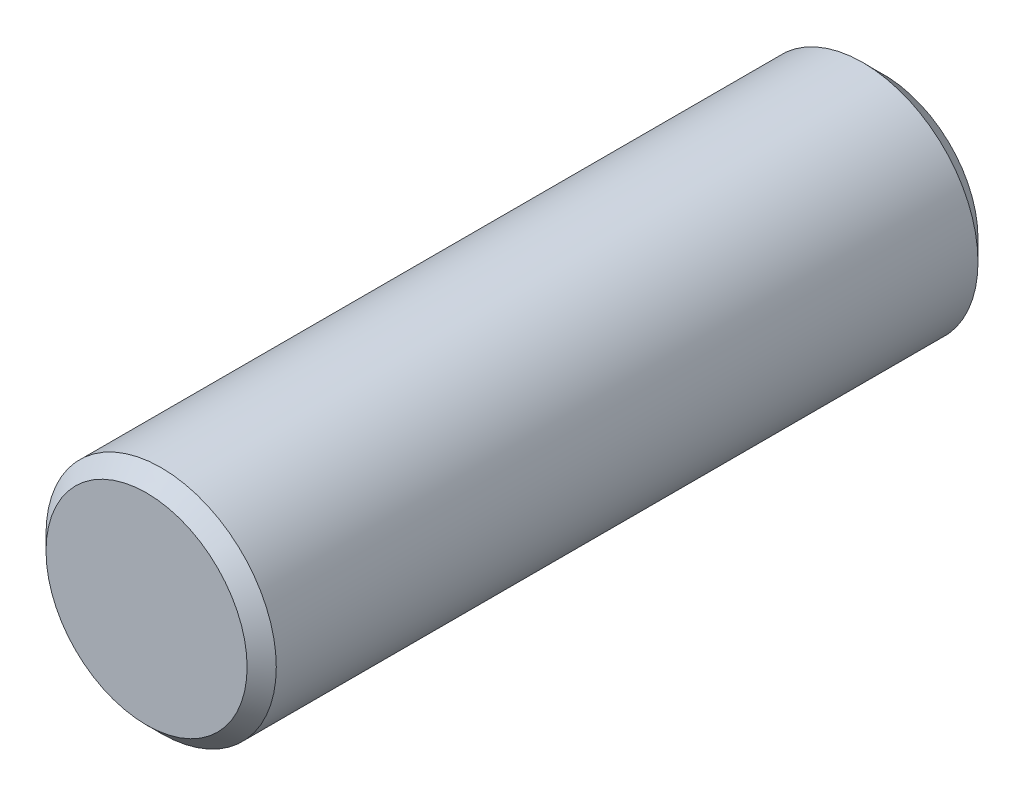
ISO-10303-21;
HEADER;
FILE_DESCRIPTION(('STEP AP214'),'2;1');
FILE_NAME('part.step','',(''),(''),'','','');
FILE_SCHEMA(('AUTOMOTIVE_DESIGN { 1 0 10303 214 1 1 1 1 }'));
ENDSEC;
DATA;
#1=APPLICATION_CONTEXT('core data for automotive mechanical design processes');
#2=APPLICATION_PROTOCOL_DEFINITION('international standard','automotive_design',2000,#1);
#3=PRODUCT_CONTEXT('',#1,'mechanical');
#4=PRODUCT('Part','Part','',(#3));
#5=PRODUCT_RELATED_PRODUCT_CATEGORY('part','',(#4));
#6=PRODUCT_DEFINITION_FORMATION('','',#4);
#7=PRODUCT_DEFINITION_CONTEXT('part definition',#1,'design');
#8=PRODUCT_DEFINITION('design','',#6,#7);
#9=PRODUCT_DEFINITION_SHAPE('','',#8);
#10=(LENGTH_UNIT() NAMED_UNIT(*) SI_UNIT(.MILLI.,.METRE.));
#11=(NAMED_UNIT(*) PLANE_ANGLE_UNIT() SI_UNIT($,.RADIAN.));
#12=(NAMED_UNIT(*) SI_UNIT($,.STERADIAN.) SOLID_ANGLE_UNIT());
#13=UNCERTAINTY_MEASURE_WITH_UNIT(LENGTH_MEASURE(1.E-05),#10,'distance_accuracy_value','');
#14=(GEOMETRIC_REPRESENTATION_CONTEXT(3) GLOBAL_UNCERTAINTY_ASSIGNED_CONTEXT((#13)) GLOBAL_UNIT_ASSIGNED_CONTEXT((#10,
#11,#12)) REPRESENTATION_CONTEXT('',''));
#15=CARTESIAN_POINT('',(0.,0.,0.));
#16=DIRECTION('',(0.,0.,1.));
#17=DIRECTION('',(1.,0.,0.));
#18=AXIS2_PLACEMENT_3D('',#15,#16,#17);
#19=CARTESIAN_POINT('',(0.,0.,6.35));
#20=DIRECTION('',(0.,0.,-1.));
#21=DIRECTION('',(-1.,0.,0.));
#22=AXIS2_PLACEMENT_3D('',#19,#20,#21);
#23=PLANE('',#22);
#24=CARTESIAN_POINT('',(0.,0.,6.35));
#25=DIRECTION('',(0.,0.,1.));
#26=DIRECTION('',(1.,0.,0.));
#27=AXIS2_PLACEMENT_3D('',#24,#25,#26);
#28=CIRCLE('',#27,1.7329278286101);
#29=CARTESIAN_POINT('',(1.7329278286101,0.,6.35));
#30=VERTEX_POINT('',#29);
#31=EDGE_CURVE('E10',#30,#30,#28,.T.);
#32=ORIENTED_EDGE('',*,*,#31,.T.);
#33=EDGE_LOOP('',(#32));
#34=FACE_BOUND('',#33,.T.);
#35=ADVANCED_FACE('F32',(#34),#23,.F.);
#36=CARTESIAN_POINT('',(0.,0.,6.0985528286101));
#37=DIRECTION('',(0.,0.,-1.));
#38=DIRECTION('',(-1.,0.,0.));
#39=AXIS2_PLACEMENT_3D('',#36,#37,#38);
#40=CONICAL_SURFACE('',#39,1.984375,0.78539816339745);
#41=ORIENTED_EDGE('',*,*,#31,.F.);
#42=EDGE_LOOP('',(#41));
#43=FACE_BOUND('',#42,.T.);
#44=CARTESIAN_POINT('',(0.,0.,6.0985528286101));
#45=DIRECTION('',(0.,0.,1.));
#46=DIRECTION('',(1.,0.,0.));
#47=AXIS2_PLACEMENT_3D('',#44,#45,#46);
#48=CIRCLE('',#47,1.984375);
#49=CARTESIAN_POINT('',(1.984375,0.,6.0985528286101));
#50=VERTEX_POINT('',#49);
#51=EDGE_CURVE('E38',#50,#50,#48,.T.);
#52=ORIENTED_EDGE('',*,*,#51,.T.);
#53=EDGE_LOOP('',(#52));
#54=FACE_BOUND('',#53,.T.);
#55=ADVANCED_FACE('F64',(#43,#54),#40,.T.);
#56=CARTESIAN_POINT('',(0.,0.,-6.35));
#57=DIRECTION('',(0.,0.,1.));
#58=DIRECTION('',(1.,0.,0.));
#59=AXIS2_PLACEMENT_3D('',#56,#57,#58);
#60=CYLINDRICAL_SURFACE('',#59,1.984375);
#61=ORIENTED_EDGE('',*,*,#51,.F.);
#62=EDGE_LOOP('',(#61));
#63=FACE_BOUND('',#62,.T.);
#64=CARTESIAN_POINT('',(0.,0.,-5.9944));
#65=DIRECTION('',(0.,0.,1.));
#66=DIRECTION('',(1.,0.,0.));
#67=AXIS2_PLACEMENT_3D('',#64,#65,#66);
#68=CIRCLE('',#67,1.984375);
#69=CARTESIAN_POINT('',(1.984375,0.,-5.9944));
#70=VERTEX_POINT('',#69);
#71=EDGE_CURVE('E42',#70,#70,#68,.T.);
#72=ORIENTED_EDGE('',*,*,#71,.T.);
#73=EDGE_LOOP('',(#72));
#74=FACE_BOUND('',#73,.T.);
#75=ADVANCED_FACE('F60',(#63,#74),#60,.T.);
#76=CARTESIAN_POINT('',(0.,0.,-6.35));
#77=DIRECTION('',(0.,0.,1.));
#78=DIRECTION('',(1.,0.,0.));
#79=AXIS2_PLACEMENT_3D('',#76,#77,#78);
#80=CONICAL_SURFACE('',#79,1.628775,0.785398163397448);
#81=ORIENTED_EDGE('',*,*,#71,.F.);
#82=EDGE_LOOP('',(#81));
#83=FACE_BOUND('',#82,.T.);
#84=CARTESIAN_POINT('',(0.,0.,-6.35));
#85=DIRECTION('',(0.,0.,1.));
#86=DIRECTION('',(1.,0.,0.));
#87=AXIS2_PLACEMENT_3D('',#84,#85,#86);
#88=CIRCLE('',#87,1.628775);
#89=CARTESIAN_POINT('',(1.628775,0.,-6.35));
#90=VERTEX_POINT('',#89);
#91=EDGE_CURVE('E46',#90,#90,#88,.T.);
#92=ORIENTED_EDGE('',*,*,#91,.T.);
#93=EDGE_LOOP('',(#92));
#94=FACE_BOUND('',#93,.T.);
#95=ADVANCED_FACE('F52',(#83,#94),#80,.T.);
#96=CARTESIAN_POINT('',(0.,1.628775,-6.35));
#97=DIRECTION('',(0.,0.,1.));
#98=DIRECTION('',(1.,0.,0.));
#99=AXIS2_PLACEMENT_3D('',#96,#97,#98);
#100=PLANE('',#99);
#101=ORIENTED_EDGE('',*,*,#91,.F.);
#102=EDGE_LOOP('',(#101));
#103=FACE_BOUND('',#102,.T.);
#104=ADVANCED_FACE('F54',(#103),#100,.F.);
#105=CLOSED_SHELL('',(#35,#55,#75,#95,#104));
#106=MANIFOLD_SOLID_BREP('B2',#105);
#107=ADVANCED_BREP_SHAPE_REPRESENTATION('',(#18,#106),#14);
#108=SHAPE_DEFINITION_REPRESENTATION(#9,#107);
ENDSEC;
END-ISO-10303-21;
